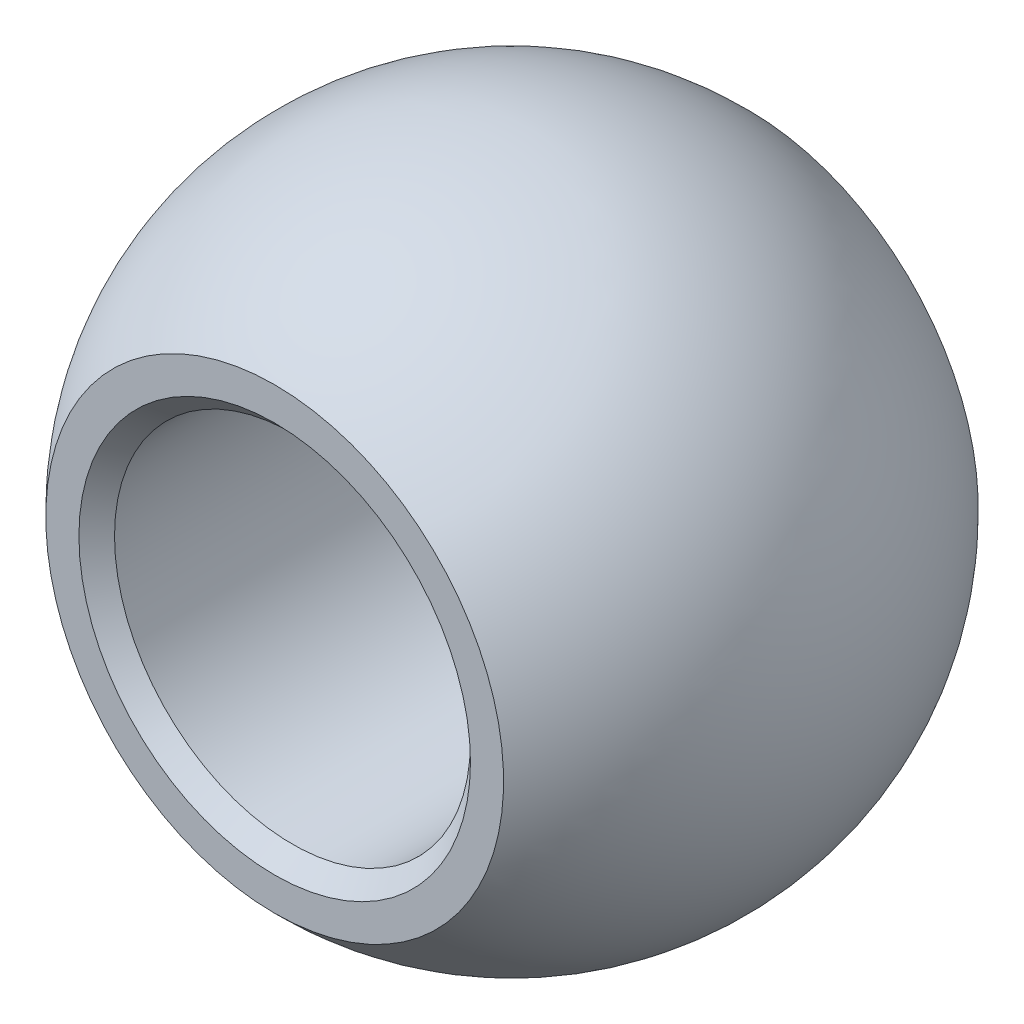
ISO-10303-21;
HEADER;
FILE_DESCRIPTION(('STEP AP214'),'2;1');
FILE_NAME('part.step','',(''),(''),'','','');
FILE_SCHEMA(('AUTOMOTIVE_DESIGN { 1 0 10303 214 1 1 1 1 }'));
ENDSEC;
DATA;
#1=APPLICATION_CONTEXT('core data for automotive mechanical design processes');
#2=APPLICATION_PROTOCOL_DEFINITION('international standard','automotive_design',2000,#1);
#3=PRODUCT_CONTEXT('',#1,'mechanical');
#4=PRODUCT('Part','Part','',(#3));
#5=PRODUCT_RELATED_PRODUCT_CATEGORY('part','',(#4));
#6=PRODUCT_DEFINITION_FORMATION('','',#4);
#7=PRODUCT_DEFINITION_CONTEXT('part definition',#1,'design');
#8=PRODUCT_DEFINITION('design','',#6,#7);
#9=PRODUCT_DEFINITION_SHAPE('','',#8);
#10=(LENGTH_UNIT() NAMED_UNIT(*) SI_UNIT(.MILLI.,.METRE.));
#11=(NAMED_UNIT(*) PLANE_ANGLE_UNIT() SI_UNIT($,.RADIAN.));
#12=(NAMED_UNIT(*) SI_UNIT($,.STERADIAN.) SOLID_ANGLE_UNIT());
#13=UNCERTAINTY_MEASURE_WITH_UNIT(LENGTH_MEASURE(1.E-05),#10,'distance_accuracy_value','');
#14=(GEOMETRIC_REPRESENTATION_CONTEXT(3) GLOBAL_UNCERTAINTY_ASSIGNED_CONTEXT((#13)) GLOBAL_UNIT_ASSIGNED_CONTEXT((#10,
#11,#12)) REPRESENTATION_CONTEXT('',''));
#15=CARTESIAN_POINT('',(0.,0.,0.));
#16=DIRECTION('',(0.,0.,1.));
#17=DIRECTION('',(1.,0.,0.));
#18=AXIS2_PLACEMENT_3D('',#15,#16,#17);
#19=CARTESIAN_POINT('',(0.,0.,0.));
#20=DIRECTION('',(0.,1.,0.));
#21=DIRECTION('',(1.,0.,0.));
#22=AXIS2_PLACEMENT_3D('',#19,#20,#21);
#23=SPHERICAL_SURFACE('',#22,11.115);
#24=CARTESIAN_POINT('',(0.,0.,0.));
#25=DIRECTION('',(0.,0.,1.));
#26=DIRECTION('',(0.,-1.,0.));
#27=AXIS2_PLACEMENT_3D('',#24,#25,#26);
#28=SPHERICAL_SURFACE('',#27,11.115);
#29=CARTESIAN_POINT('',(0.,0.,-8.));
#30=DIRECTION('',(0.,0.,1.));
#31=DIRECTION('',(0.,-1.,0.));
#32=AXIS2_PLACEMENT_3D('',#29,#30,#31);
#33=CIRCLE('',#32,7.71642566218324);
#34=CARTESIAN_POINT('',(0.,-7.71642566218324,-8.));
#35=VERTEX_POINT('',#34);
#36=EDGE_CURVE('E61',#35,#35,#33,.T.);
#37=ORIENTED_EDGE('',*,*,#36,.T.);
#38=EDGE_LOOP('',(#37));
#39=FACE_BOUND('',#38,.T.);
#40=CARTESIAN_POINT('',(0.,0.,8.));
#41=DIRECTION('',(0.,0.,-1.));
#42=DIRECTION('',(0.,1.,0.));
#43=AXIS2_PLACEMENT_3D('',#40,#41,#42);
#44=CIRCLE('',#43,7.71642566218323);
#45=CARTESIAN_POINT('',(0.,7.71642566218323,8.));
#46=VERTEX_POINT('',#45);
#47=EDGE_CURVE('E60',#46,#46,#44,.T.);
#48=ORIENTED_EDGE('',*,*,#47,.T.);
#49=EDGE_LOOP('',(#48));
#50=FACE_BOUND('',#49,.T.);
#51=ADVANCED_FACE('F40',(#39,#50),#28,.T.);
#52=CARTESIAN_POINT('',(-11.115,17.9071037472583,8.));
#53=DIRECTION('',(0.,0.,-1.));
#54=DIRECTION('',(0.,1.,0.));
#55=AXIS2_PLACEMENT_3D('',#52,#53,#54);
#56=PLANE('',#55);
#57=CARTESIAN_POINT('',(0.,0.,8.));
#58=DIRECTION('',(0.,0.,-1.));
#59=DIRECTION('',(0.,1.,0.));
#60=AXIS2_PLACEMENT_3D('',#57,#58,#59);
#61=CIRCLE('',#60,6.60000000000001);
#62=CARTESIAN_POINT('',(0.,6.60000000000001,8.));
#63=VERTEX_POINT('',#62);
#64=EDGE_CURVE('E10',#63,#63,#61,.T.);
#65=ORIENTED_EDGE('',*,*,#64,.T.);
#66=EDGE_LOOP('',(#65));
#67=FACE_BOUND('',#66,.T.);
#68=ORIENTED_EDGE('',*,*,#47,.F.);
#69=EDGE_LOOP('',(#68));
#70=FACE_BOUND('',#69,.T.);
#71=ADVANCED_FACE('F68',(#67,#70),#56,.F.);
#72=CARTESIAN_POINT('',(-11.115,17.9071037472583,-8.));
#73=DIRECTION('',(0.,0.,1.));
#74=DIRECTION('',(0.,-1.,0.));
#75=AXIS2_PLACEMENT_3D('',#72,#73,#74);
#76=PLANE('',#75);
#77=CARTESIAN_POINT('',(0.,0.,-8.));
#78=DIRECTION('',(0.,0.,1.));
#79=DIRECTION('',(0.,-1.,0.));
#80=AXIS2_PLACEMENT_3D('',#77,#78,#79);
#81=CIRCLE('',#80,6.6);
#82=CARTESIAN_POINT('',(0.,-6.6,-8.));
#83=VERTEX_POINT('',#82);
#84=EDGE_CURVE('E55',#83,#83,#81,.T.);
#85=ORIENTED_EDGE('',*,*,#84,.T.);
#86=EDGE_LOOP('',(#85));
#87=FACE_BOUND('',#86,.T.);
#88=ORIENTED_EDGE('',*,*,#36,.F.);
#89=EDGE_LOOP('',(#88));
#90=FACE_BOUND('',#89,.T.);
#91=ADVANCED_FACE('F70',(#87,#90),#76,.F.);
#92=CARTESIAN_POINT('',(0.,0.,-8.));
#93=DIRECTION('',(0.,0.,1.));
#94=DIRECTION('',(1.,0.,0.));
#95=AXIS2_PLACEMENT_3D('',#92,#93,#94);
#96=CYLINDRICAL_SURFACE('',#95,6.);
#97=CARTESIAN_POINT('',(0.,0.,-7.4));
#98=DIRECTION('',(0.,0.,1.));
#99=DIRECTION('',(1.,0.,0.));
#100=AXIS2_PLACEMENT_3D('',#97,#98,#99);
#101=CIRCLE('',#100,6.);
#102=CARTESIAN_POINT('',(6.,0.,-7.4));
#103=VERTEX_POINT('',#102);
#104=EDGE_CURVE('E47',#103,#103,#101,.F.);
#105=ORIENTED_EDGE('',*,*,#104,.T.);
#106=EDGE_LOOP('',(#105));
#107=FACE_BOUND('',#106,.T.);
#108=CARTESIAN_POINT('',(0.,0.,7.4));
#109=DIRECTION('',(0.,0.,-1.));
#110=DIRECTION('',(-1.,0.,0.));
#111=AXIS2_PLACEMENT_3D('',#108,#109,#110);
#112=CIRCLE('',#111,6.);
#113=CARTESIAN_POINT('',(-6.,0.,7.4));
#114=VERTEX_POINT('',#113);
#115=EDGE_CURVE('E51',#114,#114,#112,.F.);
#116=ORIENTED_EDGE('',*,*,#115,.T.);
#117=EDGE_LOOP('',(#116));
#118=FACE_BOUND('',#117,.T.);
#119=ADVANCED_FACE('F76',(#107,#118),#96,.F.);
#120=CARTESIAN_POINT('',(0.,0.,-8.));
#121=DIRECTION('',(0.,0.,-1.));
#122=DIRECTION('',(-1.,0.,0.));
#123=AXIS2_PLACEMENT_3D('',#120,#121,#122);
#124=CONICAL_SURFACE('',#123,6.6,0.785398163397448);
#125=ORIENTED_EDGE('',*,*,#104,.F.);
#126=EDGE_LOOP('',(#125));
#127=FACE_BOUND('',#126,.T.);
#128=ORIENTED_EDGE('',*,*,#84,.F.);
#129=EDGE_LOOP('',(#128));
#130=FACE_BOUND('',#129,.T.);
#131=ADVANCED_FACE('F82',(#127,#130),#124,.F.);
#132=CARTESIAN_POINT('',(0.,0.,7.4));
#133=DIRECTION('',(0.,0.,1.));
#134=DIRECTION('',(1.,0.,0.));
#135=AXIS2_PLACEMENT_3D('',#132,#133,#134);
#136=CONICAL_SURFACE('',#135,6.,0.785398163397452);
#137=ORIENTED_EDGE('',*,*,#64,.F.);
#138=EDGE_LOOP('',(#137));
#139=FACE_BOUND('',#138,.T.);
#140=ORIENTED_EDGE('',*,*,#115,.F.);
#141=EDGE_LOOP('',(#140));
#142=FACE_BOUND('',#141,.T.);
#143=ADVANCED_FACE('F42',(#139,#142),#136,.F.);
#144=CLOSED_SHELL('',(#51,#71,#91,#119,#131,#143));
#145=MANIFOLD_SOLID_BREP('B2',#144);
#146=ADVANCED_BREP_SHAPE_REPRESENTATION('',(#18,#145),#14);
#147=SHAPE_DEFINITION_REPRESENTATION(#9,#146);
ENDSEC;
END-ISO-10303-21;
